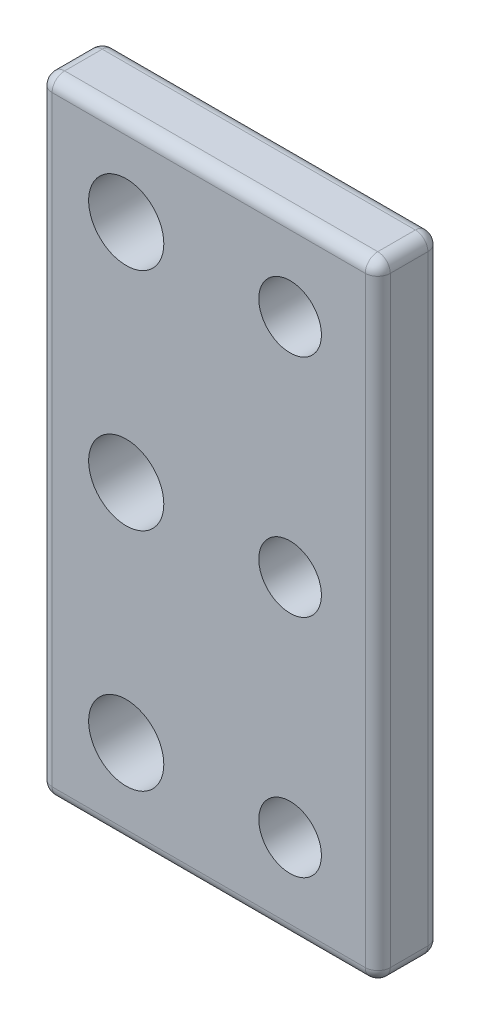
ISO-10303-21;
HEADER;
FILE_DESCRIPTION(('STEP AP214'),'2;1');
FILE_NAME('part.step','',(''),(''),'','','');
FILE_SCHEMA(('AUTOMOTIVE_DESIGN { 1 0 10303 214 1 1 1 1 }'));
ENDSEC;
DATA;
#1=APPLICATION_CONTEXT('core data for automotive mechanical design processes');
#2=APPLICATION_PROTOCOL_DEFINITION('international standard','automotive_design',2000,#1);
#3=PRODUCT_CONTEXT('',#1,'mechanical');
#4=PRODUCT('Part','Part','',(#3));
#5=PRODUCT_RELATED_PRODUCT_CATEGORY('part','',(#4));
#6=PRODUCT_DEFINITION_FORMATION('','',#4);
#7=PRODUCT_DEFINITION_CONTEXT('part definition',#1,'design');
#8=PRODUCT_DEFINITION('design','',#6,#7);
#9=PRODUCT_DEFINITION_SHAPE('','',#8);
#10=(LENGTH_UNIT() NAMED_UNIT(*) SI_UNIT(.MILLI.,.METRE.));
#11=(NAMED_UNIT(*) PLANE_ANGLE_UNIT() SI_UNIT($,.RADIAN.));
#12=(NAMED_UNIT(*) SI_UNIT($,.STERADIAN.) SOLID_ANGLE_UNIT());
#13=UNCERTAINTY_MEASURE_WITH_UNIT(LENGTH_MEASURE(1.E-05),#10,'distance_accuracy_value','');
#14=(GEOMETRIC_REPRESENTATION_CONTEXT(3) GLOBAL_UNCERTAINTY_ASSIGNED_CONTEXT((#13)) GLOBAL_UNIT_ASSIGNED_CONTEXT((#10,
#11,#12)) REPRESENTATION_CONTEXT('',''));
#15=CARTESIAN_POINT('',(0.,0.,0.));
#16=DIRECTION('',(0.,0.,1.));
#17=DIRECTION('',(1.,0.,0.));
#18=AXIS2_PLACEMENT_3D('',#15,#16,#17);
#19=CARTESIAN_POINT('',(0.,0.,5.));
#20=DIRECTION('',(0.,0.,1.));
#21=DIRECTION('',(1.,0.,0.));
#22=AXIS2_PLACEMENT_3D('',#19,#20,#21);
#23=PLANE('',#22);
#24=DIRECTION('',(0.,-1.,0.));
#25=VECTOR('',#24,1.);
#26=CARTESIAN_POINT('',(-12.5,-25.,5.));
#27=LINE('',#26,#25);
#28=CARTESIAN_POINT('',(-12.5,24.,5.));
#29=VERTEX_POINT('',#28);
#30=CARTESIAN_POINT('',(-12.5,-24.,5.));
#31=VERTEX_POINT('',#30);
#32=EDGE_CURVE('E136',#29,#31,#27,.T.);
#33=ORIENTED_EDGE('',*,*,#32,.T.);
#34=DIRECTION('',(1.,0.,0.));
#35=VECTOR('',#34,1.);
#36=CARTESIAN_POINT('',(13.5,-24.,5.));
#37=LINE('',#36,#35);
#38=CARTESIAN_POINT('',(12.5,-24.,5.));
#39=VERTEX_POINT('',#38);
#40=EDGE_CURVE('E181',#31,#39,#37,.T.);
#41=ORIENTED_EDGE('',*,*,#40,.T.);
#42=DIRECTION('',(0.,1.,0.));
#43=VECTOR('',#42,1.);
#44=CARTESIAN_POINT('',(12.5,25.,5.));
#45=LINE('',#44,#43);
#46=CARTESIAN_POINT('',(12.5,24.,5.));
#47=VERTEX_POINT('',#46);
#48=EDGE_CURVE('E139',#39,#47,#45,.T.);
#49=ORIENTED_EDGE('',*,*,#48,.T.);
#50=DIRECTION('',(-1.,0.,0.));
#51=VECTOR('',#50,1.);
#52=CARTESIAN_POINT('',(-13.5,24.,5.));
#53=LINE('',#52,#51);
#54=EDGE_CURVE('E131',#47,#29,#53,.T.);
#55=ORIENTED_EDGE('',*,*,#54,.T.);
#56=EDGE_LOOP('',(#33,#41,#49,#55));
#57=FACE_BOUND('',#56,.T.);
#58=CARTESIAN_POINT('',(6.5,0.,5.));
#59=DIRECTION('',(0.,0.,1.));
#60=DIRECTION('',(1.,0.,0.));
#61=AXIS2_PLACEMENT_3D('',#58,#59,#60);
#62=CIRCLE('',#61,2.5);
#63=CARTESIAN_POINT('',(9.,0.,5.));
#64=VERTEX_POINT('',#63);
#65=EDGE_CURVE('E334',#64,#64,#62,.T.);
#66=ORIENTED_EDGE('',*,*,#65,.F.);
#67=EDGE_LOOP('',(#66));
#68=FACE_BOUND('',#67,.T.);
#69=CARTESIAN_POINT('',(-6.58299282300101,-18.,5.));
#70=DIRECTION('',(0.,0.,1.));
#71=DIRECTION('',(1.,0.,0.));
#72=AXIS2_PLACEMENT_3D('',#69,#70,#71);
#73=CIRCLE('',#72,3.);
#74=CARTESIAN_POINT('',(-3.58299282300101,-18.,5.));
#75=VERTEX_POINT('',#74);
#76=EDGE_CURVE('E350',#75,#75,#73,.T.);
#77=ORIENTED_EDGE('',*,*,#76,.F.);
#78=EDGE_LOOP('',(#77));
#79=FACE_BOUND('',#78,.T.);
#80=CARTESIAN_POINT('',(-6.58299282300101,18.,5.));
#81=DIRECTION('',(0.,0.,1.));
#82=DIRECTION('',(1.,0.,0.));
#83=AXIS2_PLACEMENT_3D('',#80,#81,#82);
#84=CIRCLE('',#83,3.);
#85=CARTESIAN_POINT('',(-3.58299282300101,18.,5.));
#86=VERTEX_POINT('',#85);
#87=EDGE_CURVE('E171',#86,#86,#84,.T.);
#88=ORIENTED_EDGE('',*,*,#87,.F.);
#89=EDGE_LOOP('',(#88));
#90=FACE_BOUND('',#89,.T.);
#91=CARTESIAN_POINT('',(-6.58299282300101,0.,5.));
#92=DIRECTION('',(0.,0.,1.));
#93=DIRECTION('',(1.,0.,0.));
#94=AXIS2_PLACEMENT_3D('',#91,#92,#93);
#95=CIRCLE('',#94,3.);
#96=CARTESIAN_POINT('',(-3.58299282300101,0.,5.));
#97=VERTEX_POINT('',#96);
#98=EDGE_CURVE('E358',#97,#97,#95,.T.);
#99=ORIENTED_EDGE('',*,*,#98,.F.);
#100=EDGE_LOOP('',(#99));
#101=FACE_BOUND('',#100,.T.);
#102=CARTESIAN_POINT('',(6.5,18.,5.));
#103=DIRECTION('',(0.,0.,1.));
#104=DIRECTION('',(1.,0.,0.));
#105=AXIS2_PLACEMENT_3D('',#102,#103,#104);
#106=CIRCLE('',#105,2.5);
#107=CARTESIAN_POINT('',(9.,18.,5.));
#108=VERTEX_POINT('',#107);
#109=EDGE_CURVE('E342',#108,#108,#106,.T.);
#110=ORIENTED_EDGE('',*,*,#109,.F.);
#111=EDGE_LOOP('',(#110));
#112=FACE_BOUND('',#111,.T.);
#113=CARTESIAN_POINT('',(6.5,-18.,5.));
#114=DIRECTION('',(0.,0.,1.));
#115=DIRECTION('',(1.,0.,0.));
#116=AXIS2_PLACEMENT_3D('',#113,#114,#115);
#117=CIRCLE('',#116,2.5);
#118=CARTESIAN_POINT('',(9.,-18.,5.));
#119=VERTEX_POINT('',#118);
#120=EDGE_CURVE('E325',#119,#119,#117,.T.);
#121=ORIENTED_EDGE('',*,*,#120,.F.);
#122=EDGE_LOOP('',(#121));
#123=FACE_BOUND('',#122,.T.);
#124=ADVANCED_FACE('F43',(#57,#68,#79,#90,#101,#112,#123),#23,.T.);
#125=CARTESIAN_POINT('',(0.,0.,0.));
#126=DIRECTION('',(0.,0.,1.));
#127=DIRECTION('',(1.,0.,0.));
#128=AXIS2_PLACEMENT_3D('',#125,#126,#127);
#129=PLANE('',#128);
#130=DIRECTION('',(0.,1.,0.));
#131=VECTOR('',#130,1.);
#132=CARTESIAN_POINT('',(12.5,0.,0.));
#133=LINE('',#132,#131);
#134=CARTESIAN_POINT('',(12.5,24.,0.));
#135=VERTEX_POINT('',#134);
#136=CARTESIAN_POINT('',(12.5,-24.,0.));
#137=VERTEX_POINT('',#136);
#138=EDGE_CURVE('E203',#135,#137,#133,.F.);
#139=ORIENTED_EDGE('',*,*,#138,.T.);
#140=DIRECTION('',(1.,0.,0.));
#141=VECTOR('',#140,1.);
#142=CARTESIAN_POINT('',(0.,-24.,0.));
#143=LINE('',#142,#141);
#144=CARTESIAN_POINT('',(-12.5,-24.,0.));
#145=VERTEX_POINT('',#144);
#146=EDGE_CURVE('E206',#137,#145,#143,.F.);
#147=ORIENTED_EDGE('',*,*,#146,.T.);
#148=DIRECTION('',(0.,-1.,0.));
#149=VECTOR('',#148,1.);
#150=CARTESIAN_POINT('',(-12.5,0.,0.));
#151=LINE('',#150,#149);
#152=CARTESIAN_POINT('',(-12.5,24.,0.));
#153=VERTEX_POINT('',#152);
#154=EDGE_CURVE('E197',#145,#153,#151,.F.);
#155=ORIENTED_EDGE('',*,*,#154,.T.);
#156=DIRECTION('',(-1.,0.,0.));
#157=VECTOR('',#156,1.);
#158=CARTESIAN_POINT('',(0.,24.,0.));
#159=LINE('',#158,#157);
#160=EDGE_CURVE('E200',#153,#135,#159,.F.);
#161=ORIENTED_EDGE('',*,*,#160,.T.);
#162=EDGE_LOOP('',(#139,#147,#155,#161));
#163=FACE_BOUND('',#162,.T.);
#164=CARTESIAN_POINT('',(-6.58299282300101,18.,0.));
#165=DIRECTION('',(0.,0.,1.));
#166=DIRECTION('',(1.,0.,0.));
#167=AXIS2_PLACEMENT_3D('',#164,#165,#166);
#168=CIRCLE('',#167,3.);
#169=CARTESIAN_POINT('',(-3.58299282300101,18.,0.));
#170=VERTEX_POINT('',#169);
#171=EDGE_CURVE('E175',#170,#170,#168,.T.);
#172=ORIENTED_EDGE('',*,*,#171,.T.);
#173=EDGE_LOOP('',(#172));
#174=FACE_BOUND('',#173,.T.);
#175=CARTESIAN_POINT('',(-6.58299282300101,0.,0.));
#176=DIRECTION('',(0.,0.,1.));
#177=DIRECTION('',(1.,0.,0.));
#178=AXIS2_PLACEMENT_3D('',#175,#176,#177);
#179=CIRCLE('',#178,3.);
#180=CARTESIAN_POINT('',(-3.58299282300101,0.,0.));
#181=VERTEX_POINT('',#180);
#182=EDGE_CURVE('E354',#181,#181,#179,.T.);
#183=ORIENTED_EDGE('',*,*,#182,.T.);
#184=EDGE_LOOP('',(#183));
#185=FACE_BOUND('',#184,.T.);
#186=CARTESIAN_POINT('',(-6.58299282300101,-18.,0.));
#187=DIRECTION('',(0.,0.,1.));
#188=DIRECTION('',(1.,0.,0.));
#189=AXIS2_PLACEMENT_3D('',#186,#187,#188);
#190=CIRCLE('',#189,3.);
#191=CARTESIAN_POINT('',(-3.58299282300101,-18.,0.));
#192=VERTEX_POINT('',#191);
#193=EDGE_CURVE('E346',#192,#192,#190,.T.);
#194=ORIENTED_EDGE('',*,*,#193,.T.);
#195=EDGE_LOOP('',(#194));
#196=FACE_BOUND('',#195,.T.);
#197=CARTESIAN_POINT('',(6.5,18.,0.));
#198=DIRECTION('',(0.,0.,1.));
#199=DIRECTION('',(1.,0.,0.));
#200=AXIS2_PLACEMENT_3D('',#197,#198,#199);
#201=CIRCLE('',#200,2.5);
#202=CARTESIAN_POINT('',(9.,18.,0.));
#203=VERTEX_POINT('',#202);
#204=EDGE_CURVE('E338',#203,#203,#201,.T.);
#205=ORIENTED_EDGE('',*,*,#204,.T.);
#206=EDGE_LOOP('',(#205));
#207=FACE_BOUND('',#206,.T.);
#208=CARTESIAN_POINT('',(6.5,0.,0.));
#209=DIRECTION('',(0.,0.,1.));
#210=DIRECTION('',(1.,0.,0.));
#211=AXIS2_PLACEMENT_3D('',#208,#209,#210);
#212=CIRCLE('',#211,2.5);
#213=CARTESIAN_POINT('',(9.,0.,0.));
#214=VERTEX_POINT('',#213);
#215=EDGE_CURVE('E331',#214,#214,#212,.T.);
#216=ORIENTED_EDGE('',*,*,#215,.T.);
#217=EDGE_LOOP('',(#216));
#218=FACE_BOUND('',#217,.T.);
#219=CARTESIAN_POINT('',(6.5,-18.,0.));
#220=DIRECTION('',(0.,0.,1.));
#221=DIRECTION('',(1.,0.,0.));
#222=AXIS2_PLACEMENT_3D('',#219,#220,#221);
#223=CIRCLE('',#222,2.5);
#224=CARTESIAN_POINT('',(9.,-18.,0.));
#225=VERTEX_POINT('',#224);
#226=EDGE_CURVE('E318',#225,#225,#223,.T.);
#227=ORIENTED_EDGE('',*,*,#226,.T.);
#228=EDGE_LOOP('',(#227));
#229=FACE_BOUND('',#228,.T.);
#230=ADVANCED_FACE('F366',(#163,#174,#185,#196,#207,#218,#229),#129,.F.);
#231=CARTESIAN_POINT('',(13.5,25.,5.));
#232=DIRECTION('',(-1.,0.,0.));
#233=DIRECTION('',(0.,-1.,0.));
#234=AXIS2_PLACEMENT_3D('',#231,#232,#233);
#235=PLANE('',#234);
#236=DIRECTION('',(0.,1.,0.));
#237=VECTOR('',#236,1.);
#238=CARTESIAN_POINT('',(13.5,-25.,4.));
#239=LINE('',#238,#237);
#240=CARTESIAN_POINT('',(13.5,24.,4.));
#241=VERTEX_POINT('',#240);
#242=CARTESIAN_POINT('',(13.5,-24.,4.));
#243=VERTEX_POINT('',#242);
#244=EDGE_CURVE('E216',#241,#243,#239,.F.);
#245=ORIENTED_EDGE('',*,*,#244,.T.);
#246=DIRECTION('',(0.,0.,-1.));
#247=VECTOR('',#246,1.);
#248=CARTESIAN_POINT('',(13.5,-24.,5.));
#249=LINE('',#248,#247);
#250=CARTESIAN_POINT('',(13.5,-24.,1.));
#251=VERTEX_POINT('',#250);
#252=EDGE_CURVE('E219',#243,#251,#249,.T.);
#253=ORIENTED_EDGE('',*,*,#252,.T.);
#254=DIRECTION('',(0.,1.,0.));
#255=VECTOR('',#254,1.);
#256=CARTESIAN_POINT('',(13.5,25.,1.));
#257=LINE('',#256,#255);
#258=CARTESIAN_POINT('',(13.5,24.,1.));
#259=VERTEX_POINT('',#258);
#260=EDGE_CURVE('E213',#251,#259,#257,.T.);
#261=ORIENTED_EDGE('',*,*,#260,.T.);
#262=DIRECTION('',(0.,0.,-1.));
#263=VECTOR('',#262,1.);
#264=CARTESIAN_POINT('',(13.5,24.,5.));
#265=LINE('',#264,#263);
#266=EDGE_CURVE('E210',#259,#241,#265,.F.);
#267=ORIENTED_EDGE('',*,*,#266,.T.);
#268=EDGE_LOOP('',(#245,#253,#261,#267));
#269=FACE_BOUND('',#268,.T.);
#270=ADVANCED_FACE('F390',(#269),#235,.F.);
#271=CARTESIAN_POINT('',(-13.5,25.,5.));
#272=DIRECTION('',(0.,-1.,0.));
#273=DIRECTION('',(0.,0.,-1.));
#274=AXIS2_PLACEMENT_3D('',#271,#272,#273);
#275=PLANE('',#274);
#276=DIRECTION('',(-1.,0.,0.));
#277=VECTOR('',#276,1.);
#278=CARTESIAN_POINT('',(13.5,25.,4.));
#279=LINE('',#278,#277);
#280=CARTESIAN_POINT('',(-12.5,25.,4.));
#281=VERTEX_POINT('',#280);
#282=CARTESIAN_POINT('',(12.5,25.,4.));
#283=VERTEX_POINT('',#282);
#284=EDGE_CURVE('E150',#281,#283,#279,.F.);
#285=ORIENTED_EDGE('',*,*,#284,.T.);
#286=DIRECTION('',(0.,0.,-1.));
#287=VECTOR('',#286,1.);
#288=CARTESIAN_POINT('',(12.5,25.,5.));
#289=LINE('',#288,#287);
#290=CARTESIAN_POINT('',(12.5,25.,1.));
#291=VERTEX_POINT('',#290);
#292=EDGE_CURVE('E231',#283,#291,#289,.T.);
#293=ORIENTED_EDGE('',*,*,#292,.T.);
#294=DIRECTION('',(-1.,0.,0.));
#295=VECTOR('',#294,1.);
#296=CARTESIAN_POINT('',(-13.5,25.,1.));
#297=LINE('',#296,#295);
#298=CARTESIAN_POINT('',(-12.5,25.,1.));
#299=VERTEX_POINT('',#298);
#300=EDGE_CURVE('E226',#291,#299,#297,.T.);
#301=ORIENTED_EDGE('',*,*,#300,.T.);
#302=DIRECTION('',(0.,0.,-1.));
#303=VECTOR('',#302,1.);
#304=CARTESIAN_POINT('',(-12.5,25.,5.));
#305=LINE('',#304,#303);
#306=EDGE_CURVE('E223',#299,#281,#305,.F.);
#307=ORIENTED_EDGE('',*,*,#306,.T.);
#308=EDGE_LOOP('',(#285,#293,#301,#307));
#309=FACE_BOUND('',#308,.T.);
#310=ADVANCED_FACE('F400',(#309),#275,.F.);
#311=CARTESIAN_POINT('',(-13.5,25.,5.));
#312=DIRECTION('',(1.,0.,0.));
#313=DIRECTION('',(0.,1.,0.));
#314=AXIS2_PLACEMENT_3D('',#311,#312,#313);
#315=PLANE('',#314);
#316=DIRECTION('',(0.,-1.,0.));
#317=VECTOR('',#316,1.);
#318=CARTESIAN_POINT('',(-13.5,25.,4.));
#319=LINE('',#318,#317);
#320=CARTESIAN_POINT('',(-13.5,-24.,4.));
#321=VERTEX_POINT('',#320);
#322=CARTESIAN_POINT('',(-13.5,24.,4.));
#323=VERTEX_POINT('',#322);
#324=EDGE_CURVE('E53',#321,#323,#319,.F.);
#325=ORIENTED_EDGE('',*,*,#324,.T.);
#326=DIRECTION('',(0.,0.,-1.));
#327=VECTOR('',#326,1.);
#328=CARTESIAN_POINT('',(-13.5,24.,5.));
#329=LINE('',#328,#327);
#330=CARTESIAN_POINT('',(-13.5,24.,1.));
#331=VERTEX_POINT('',#330);
#332=EDGE_CURVE('E11',#323,#331,#329,.T.);
#333=ORIENTED_EDGE('',*,*,#332,.T.);
#334=DIRECTION('',(0.,-1.,0.));
#335=VECTOR('',#334,1.);
#336=CARTESIAN_POINT('',(-13.5,25.,1.));
#337=LINE('',#336,#335);
#338=CARTESIAN_POINT('',(-13.5,-24.,1.));
#339=VERTEX_POINT('',#338);
#340=EDGE_CURVE('E235',#331,#339,#337,.T.);
#341=ORIENTED_EDGE('',*,*,#340,.T.);
#342=DIRECTION('',(0.,0.,-1.));
#343=VECTOR('',#342,1.);
#344=CARTESIAN_POINT('',(-13.5,-24.,5.));
#345=LINE('',#344,#343);
#346=EDGE_CURVE('E64',#339,#321,#345,.F.);
#347=ORIENTED_EDGE('',*,*,#346,.T.);
#348=EDGE_LOOP('',(#325,#333,#341,#347));
#349=FACE_BOUND('',#348,.T.);
#350=ADVANCED_FACE('F396',(#349),#315,.F.);
#351=CARTESIAN_POINT('',(-13.5,-25.,5.));
#352=DIRECTION('',(0.,1.,0.));
#353=DIRECTION('',(0.,0.,1.));
#354=AXIS2_PLACEMENT_3D('',#351,#352,#353);
#355=PLANE('',#354);
#356=DIRECTION('',(1.,0.,0.));
#357=VECTOR('',#356,1.);
#358=CARTESIAN_POINT('',(-13.5,-25.,1.));
#359=LINE('',#358,#357);
#360=CARTESIAN_POINT('',(-12.5,-25.,1.));
#361=VERTEX_POINT('',#360);
#362=CARTESIAN_POINT('',(12.5,-25.,1.));
#363=VERTEX_POINT('',#362);
#364=EDGE_CURVE('E187',#361,#363,#359,.T.);
#365=ORIENTED_EDGE('',*,*,#364,.T.);
#366=DIRECTION('',(0.,0.,-1.));
#367=VECTOR('',#366,1.);
#368=CARTESIAN_POINT('',(12.5,-25.,5.));
#369=LINE('',#368,#367);
#370=CARTESIAN_POINT('',(12.5,-25.,4.));
#371=VERTEX_POINT('',#370);
#372=EDGE_CURVE('E194',#363,#371,#369,.F.);
#373=ORIENTED_EDGE('',*,*,#372,.T.);
#374=DIRECTION('',(1.,0.,0.));
#375=VECTOR('',#374,1.);
#376=CARTESIAN_POINT('',(-13.5,-25.,4.));
#377=LINE('',#376,#375);
#378=CARTESIAN_POINT('',(-12.5,-25.,4.));
#379=VERTEX_POINT('',#378);
#380=EDGE_CURVE('E190',#371,#379,#377,.F.);
#381=ORIENTED_EDGE('',*,*,#380,.T.);
#382=DIRECTION('',(0.,0.,-1.));
#383=VECTOR('',#382,1.);
#384=CARTESIAN_POINT('',(-12.5,-25.,5.));
#385=LINE('',#384,#383);
#386=EDGE_CURVE('E184',#379,#361,#385,.T.);
#387=ORIENTED_EDGE('',*,*,#386,.T.);
#388=EDGE_LOOP('',(#365,#373,#381,#387));
#389=FACE_BOUND('',#388,.T.);
#390=ADVANCED_FACE('F382',(#389),#355,.F.);
#391=CARTESIAN_POINT('',(-6.58299282300101,18.,5.));
#392=DIRECTION('',(0.,0.,-1.));
#393=DIRECTION('',(-1.,0.,0.));
#394=AXIS2_PLACEMENT_3D('',#391,#392,#393);
#395=CYLINDRICAL_SURFACE('',#394,3.);
#396=ORIENTED_EDGE('',*,*,#87,.T.);
#397=EDGE_LOOP('',(#396));
#398=FACE_BOUND('',#397,.T.);
#399=ORIENTED_EDGE('',*,*,#171,.F.);
#400=EDGE_LOOP('',(#399));
#401=FACE_BOUND('',#400,.T.);
#402=ADVANCED_FACE('F372',(#398,#401),#395,.F.);
#403=CARTESIAN_POINT('',(-6.58299282300101,0.,5.));
#404=DIRECTION('',(0.,0.,-1.));
#405=DIRECTION('',(-1.,0.,0.));
#406=AXIS2_PLACEMENT_3D('',#403,#404,#405);
#407=CYLINDRICAL_SURFACE('',#406,3.);
#408=ORIENTED_EDGE('',*,*,#98,.T.);
#409=EDGE_LOOP('',(#408));
#410=FACE_BOUND('',#409,.T.);
#411=ORIENTED_EDGE('',*,*,#182,.F.);
#412=EDGE_LOOP('',(#411));
#413=FACE_BOUND('',#412,.T.);
#414=ADVANCED_FACE('F369',(#410,#413),#407,.F.);
#415=CARTESIAN_POINT('',(-6.58299282300101,-18.,5.));
#416=DIRECTION('',(0.,0.,-1.));
#417=DIRECTION('',(-1.,0.,0.));
#418=AXIS2_PLACEMENT_3D('',#415,#416,#417);
#419=CYLINDRICAL_SURFACE('',#418,3.);
#420=ORIENTED_EDGE('',*,*,#76,.T.);
#421=EDGE_LOOP('',(#420));
#422=FACE_BOUND('',#421,.T.);
#423=ORIENTED_EDGE('',*,*,#193,.F.);
#424=EDGE_LOOP('',(#423));
#425=FACE_BOUND('',#424,.T.);
#426=ADVANCED_FACE('F371',(#422,#425),#419,.F.);
#427=CARTESIAN_POINT('',(6.5,18.,5.));
#428=DIRECTION('',(0.,0.,-1.));
#429=DIRECTION('',(-1.,0.,0.));
#430=AXIS2_PLACEMENT_3D('',#427,#428,#429);
#431=CYLINDRICAL_SURFACE('',#430,2.5);
#432=ORIENTED_EDGE('',*,*,#109,.T.);
#433=EDGE_LOOP('',(#432));
#434=FACE_BOUND('',#433,.T.);
#435=ORIENTED_EDGE('',*,*,#204,.F.);
#436=EDGE_LOOP('',(#435));
#437=FACE_BOUND('',#436,.T.);
#438=ADVANCED_FACE('F379',(#434,#437),#431,.F.);
#439=CARTESIAN_POINT('',(6.5,0.,5.));
#440=DIRECTION('',(0.,0.,-1.));
#441=DIRECTION('',(-1.,0.,0.));
#442=AXIS2_PLACEMENT_3D('',#439,#440,#441);
#443=CYLINDRICAL_SURFACE('',#442,2.5);
#444=ORIENTED_EDGE('',*,*,#65,.T.);
#445=EDGE_LOOP('',(#444));
#446=FACE_BOUND('',#445,.T.);
#447=ORIENTED_EDGE('',*,*,#215,.F.);
#448=EDGE_LOOP('',(#447));
#449=FACE_BOUND('',#448,.T.);
#450=ADVANCED_FACE('F513',(#446,#449),#443,.F.);
#451=CARTESIAN_POINT('',(6.5,-18.,5.));
#452=DIRECTION('',(0.,0.,-1.));
#453=DIRECTION('',(-1.,0.,0.));
#454=AXIS2_PLACEMENT_3D('',#451,#452,#453);
#455=CYLINDRICAL_SURFACE('',#454,2.5);
#456=ORIENTED_EDGE('',*,*,#120,.T.);
#457=EDGE_LOOP('',(#456));
#458=FACE_BOUND('',#457,.T.);
#459=ORIENTED_EDGE('',*,*,#226,.F.);
#460=EDGE_LOOP('',(#459));
#461=FACE_BOUND('',#460,.T.);
#462=ADVANCED_FACE('F476',(#458,#461),#455,.F.);
#463=CARTESIAN_POINT('',(-13.5,24.,1.));
#464=DIRECTION('',(-1.,0.,0.));
#465=DIRECTION('',(0.,0.,1.));
#466=AXIS2_PLACEMENT_3D('',#463,#464,#465);
#467=CYLINDRICAL_SURFACE('',#466,1.);
#468=CARTESIAN_POINT('',(-12.5,24.,1.));
#469=DIRECTION('',(-1.,0.,0.));
#470=DIRECTION('',(0.,0.,1.));
#471=AXIS2_PLACEMENT_3D('',#468,#469,#470);
#472=CIRCLE('',#471,1.);
#473=EDGE_CURVE('E47',#299,#153,#472,.T.);
#474=ORIENTED_EDGE('',*,*,#473,.F.);
#475=ORIENTED_EDGE('',*,*,#300,.F.);
#476=CARTESIAN_POINT('',(12.5,24.,1.));
#477=DIRECTION('',(1.,0.,0.));
#478=DIRECTION('',(0.,0.,-1.));
#479=AXIS2_PLACEMENT_3D('',#476,#477,#478);
#480=CIRCLE('',#479,1.);
#481=EDGE_CURVE('E308',#135,#291,#480,.T.);
#482=ORIENTED_EDGE('',*,*,#481,.F.);
#483=ORIENTED_EDGE('',*,*,#160,.F.);
#484=EDGE_LOOP('',(#474,#475,#482,#483));
#485=FACE_BOUND('',#484,.T.);
#486=ADVANCED_FACE('F45',(#485),#467,.T.);
#487=CARTESIAN_POINT('',(-12.5,24.,1.));
#488=DIRECTION('',(0.,0.,-1.));
#489=DIRECTION('',(-1.,0.,0.));
#490=AXIS2_PLACEMENT_3D('',#487,#488,#489);
#491=SPHERICAL_SURFACE('',#490,1.);
#492=CARTESIAN_POINT('',(-12.5,24.,1.));
#493=DIRECTION('',(0.,0.,-1.));
#494=DIRECTION('',(-1.,0.,0.));
#495=AXIS2_PLACEMENT_3D('',#492,#493,#494);
#496=CIRCLE('',#495,1.);
#497=EDGE_CURVE('E301',#299,#331,#496,.F.);
#498=ORIENTED_EDGE('',*,*,#497,.F.);
#499=ORIENTED_EDGE('',*,*,#473,.T.);
#500=CARTESIAN_POINT('',(-12.5,24.,1.));
#501=DIRECTION('',(0.,1.,0.));
#502=DIRECTION('',(0.,0.,1.));
#503=AXIS2_PLACEMENT_3D('',#500,#501,#502);
#504=CIRCLE('',#503,1.);
#505=EDGE_CURVE('E305',#331,#153,#504,.F.);
#506=ORIENTED_EDGE('',*,*,#505,.F.);
#507=EDGE_LOOP('',(#498,#499,#506));
#508=FACE_BOUND('',#507,.T.);
#509=ADVANCED_FACE('F471',(#508),#491,.T.);
#510=CARTESIAN_POINT('',(12.5,24.,1.));
#511=DIRECTION('',(0.,1.,0.));
#512=DIRECTION('',(0.,0.,1.));
#513=AXIS2_PLACEMENT_3D('',#510,#511,#512);
#514=SPHERICAL_SURFACE('',#513,1.);
#515=CARTESIAN_POINT('',(12.5,24.,1.));
#516=DIRECTION('',(0.,1.,0.));
#517=DIRECTION('',(0.,0.,1.));
#518=AXIS2_PLACEMENT_3D('',#515,#516,#517);
#519=CIRCLE('',#518,1.);
#520=EDGE_CURVE('E294',#135,#259,#519,.F.);
#521=ORIENTED_EDGE('',*,*,#520,.F.);
#522=ORIENTED_EDGE('',*,*,#481,.T.);
#523=CARTESIAN_POINT('',(12.5,24.,1.));
#524=DIRECTION('',(0.,0.,-1.));
#525=DIRECTION('',(-1.,0.,0.));
#526=AXIS2_PLACEMENT_3D('',#523,#524,#525);
#527=CIRCLE('',#526,1.);
#528=EDGE_CURVE('E298',#259,#291,#527,.F.);
#529=ORIENTED_EDGE('',*,*,#528,.F.);
#530=EDGE_LOOP('',(#521,#522,#529));
#531=FACE_BOUND('',#530,.T.);
#532=ADVANCED_FACE('F468',(#531),#514,.T.);
#533=CARTESIAN_POINT('',(-12.5,25.,1.));
#534=DIRECTION('',(0.,-1.,0.));
#535=DIRECTION('',(1.,0.,0.));
#536=AXIS2_PLACEMENT_3D('',#533,#534,#535);
#537=CYLINDRICAL_SURFACE('',#536,1.);
#538=ORIENTED_EDGE('',*,*,#505,.T.);
#539=ORIENTED_EDGE('',*,*,#154,.F.);
#540=CARTESIAN_POINT('',(-12.5,-24.,1.));
#541=DIRECTION('',(0.,-1.,0.));
#542=DIRECTION('',(0.,0.,-1.));
#543=AXIS2_PLACEMENT_3D('',#540,#541,#542);
#544=CIRCLE('',#543,1.);
#545=EDGE_CURVE('E287',#339,#145,#544,.T.);
#546=ORIENTED_EDGE('',*,*,#545,.F.);
#547=ORIENTED_EDGE('',*,*,#340,.F.);
#548=EDGE_LOOP('',(#538,#539,#546,#547));
#549=FACE_BOUND('',#548,.T.);
#550=ADVANCED_FACE('F464',(#549),#537,.T.);
#551=CARTESIAN_POINT('',(-12.5,24.,5.));
#552=DIRECTION('',(0.,0.,-1.));
#553=DIRECTION('',(-1.,0.,0.));
#554=AXIS2_PLACEMENT_3D('',#551,#552,#553);
#555=CYLINDRICAL_SURFACE('',#554,1.);
#556=ORIENTED_EDGE('',*,*,#497,.T.);
#557=ORIENTED_EDGE('',*,*,#332,.F.);
#558=CARTESIAN_POINT('',(-12.5,24.,4.));
#559=DIRECTION('',(0.,0.,1.));
#560=DIRECTION('',(1.,0.,0.));
#561=AXIS2_PLACEMENT_3D('',#558,#559,#560);
#562=CIRCLE('',#561,1.);
#563=EDGE_CURVE('E155',#281,#323,#562,.T.);
#564=ORIENTED_EDGE('',*,*,#563,.F.);
#565=ORIENTED_EDGE('',*,*,#306,.F.);
#566=EDGE_LOOP('',(#556,#557,#564,#565));
#567=FACE_BOUND('',#566,.T.);
#568=ADVANCED_FACE('F461',(#567),#555,.T.);
#569=CARTESIAN_POINT('',(0.,24.,4.));
#570=DIRECTION('',(1.,0.,0.));
#571=DIRECTION('',(0.,0.,-1.));
#572=AXIS2_PLACEMENT_3D('',#569,#570,#571);
#573=CYLINDRICAL_SURFACE('',#572,1.);
#574=CARTESIAN_POINT('',(12.5,24.,4.));
#575=DIRECTION('',(1.,0.,0.));
#576=DIRECTION('',(0.,0.,-1.));
#577=AXIS2_PLACEMENT_3D('',#574,#575,#576);
#578=CIRCLE('',#577,1.);
#579=EDGE_CURVE('E156',#283,#47,#578,.T.);
#580=ORIENTED_EDGE('',*,*,#579,.F.);
#581=ORIENTED_EDGE('',*,*,#284,.F.);
#582=CARTESIAN_POINT('',(-12.5,24.,4.));
#583=DIRECTION('',(-1.,0.,0.));
#584=DIRECTION('',(0.,0.,1.));
#585=AXIS2_PLACEMENT_3D('',#582,#583,#584);
#586=CIRCLE('',#585,1.);
#587=EDGE_CURVE('E147',#29,#281,#586,.T.);
#588=ORIENTED_EDGE('',*,*,#587,.F.);
#589=ORIENTED_EDGE('',*,*,#54,.F.);
#590=EDGE_LOOP('',(#580,#581,#588,#589));
#591=FACE_BOUND('',#590,.T.);
#592=ADVANCED_FACE('F149',(#591),#573,.T.);
#593=CARTESIAN_POINT('',(12.5,24.,5.));
#594=DIRECTION('',(0.,0.,-1.));
#595=DIRECTION('',(-1.,0.,0.));
#596=AXIS2_PLACEMENT_3D('',#593,#594,#595);
#597=CYLINDRICAL_SURFACE('',#596,1.);
#598=ORIENTED_EDGE('',*,*,#528,.T.);
#599=ORIENTED_EDGE('',*,*,#292,.F.);
#600=CARTESIAN_POINT('',(12.5,24.,4.));
#601=DIRECTION('',(0.,0.,1.));
#602=DIRECTION('',(1.,0.,0.));
#603=AXIS2_PLACEMENT_3D('',#600,#601,#602);
#604=CIRCLE('',#603,1.);
#605=EDGE_CURVE('E279',#241,#283,#604,.T.);
#606=ORIENTED_EDGE('',*,*,#605,.F.);
#607=ORIENTED_EDGE('',*,*,#266,.F.);
#608=EDGE_LOOP('',(#598,#599,#606,#607));
#609=FACE_BOUND('',#608,.T.);
#610=ADVANCED_FACE('F454',(#609),#597,.T.);
#611=CARTESIAN_POINT('',(12.5,25.,1.));
#612=DIRECTION('',(0.,1.,0.));
#613=DIRECTION('',(-1.,0.,0.));
#614=AXIS2_PLACEMENT_3D('',#611,#612,#613);
#615=CYLINDRICAL_SURFACE('',#614,1.);
#616=ORIENTED_EDGE('',*,*,#520,.T.);
#617=ORIENTED_EDGE('',*,*,#260,.F.);
#618=CARTESIAN_POINT('',(12.5,-24.,1.));
#619=DIRECTION('',(0.,-1.,0.));
#620=DIRECTION('',(0.,0.,-1.));
#621=AXIS2_PLACEMENT_3D('',#618,#619,#620);
#622=CIRCLE('',#621,1.);
#623=EDGE_CURVE('E275',#137,#251,#622,.T.);
#624=ORIENTED_EDGE('',*,*,#623,.F.);
#625=ORIENTED_EDGE('',*,*,#138,.F.);
#626=EDGE_LOOP('',(#616,#617,#624,#625));
#627=FACE_BOUND('',#626,.T.);
#628=ADVANCED_FACE('F450',(#627),#615,.T.);
#629=CARTESIAN_POINT('',(-13.5,-24.,1.));
#630=DIRECTION('',(1.,0.,0.));
#631=DIRECTION('',(0.,0.,-1.));
#632=AXIS2_PLACEMENT_3D('',#629,#630,#631);
#633=CYLINDRICAL_SURFACE('',#632,1.);
#634=CARTESIAN_POINT('',(-12.5,-24.,1.));
#635=DIRECTION('',(-1.,0.,0.));
#636=DIRECTION('',(0.,0.,1.));
#637=AXIS2_PLACEMENT_3D('',#634,#635,#636);
#638=CIRCLE('',#637,1.);
#639=EDGE_CURVE('E290',#145,#361,#638,.T.);
#640=ORIENTED_EDGE('',*,*,#639,.F.);
#641=ORIENTED_EDGE('',*,*,#146,.F.);
#642=CARTESIAN_POINT('',(12.5,-24.,1.));
#643=DIRECTION('',(1.,0.,0.));
#644=DIRECTION('',(0.,0.,-1.));
#645=AXIS2_PLACEMENT_3D('',#642,#643,#644);
#646=CIRCLE('',#645,1.);
#647=EDGE_CURVE('E271',#363,#137,#646,.T.);
#648=ORIENTED_EDGE('',*,*,#647,.F.);
#649=ORIENTED_EDGE('',*,*,#364,.F.);
#650=EDGE_LOOP('',(#640,#641,#648,#649));
#651=FACE_BOUND('',#650,.T.);
#652=ADVANCED_FACE('F446',(#651),#633,.T.);
#653=CARTESIAN_POINT('',(-12.5,-24.,1.));
#654=DIRECTION('',(0.,0.,-1.));
#655=DIRECTION('',(-1.,0.,0.));
#656=AXIS2_PLACEMENT_3D('',#653,#654,#655);
#657=SPHERICAL_SURFACE('',#656,1.);
#658=ORIENTED_EDGE('',*,*,#545,.T.);
#659=ORIENTED_EDGE('',*,*,#639,.T.);
#660=CARTESIAN_POINT('',(-12.5,-24.,1.));
#661=DIRECTION('',(0.,0.,-1.));
#662=DIRECTION('',(-1.,0.,0.));
#663=AXIS2_PLACEMENT_3D('',#660,#661,#662);
#664=CIRCLE('',#663,1.);
#665=EDGE_CURVE('E163',#339,#361,#664,.F.);
#666=ORIENTED_EDGE('',*,*,#665,.F.);
#667=EDGE_LOOP('',(#658,#659,#666));
#668=FACE_BOUND('',#667,.T.);
#669=ADVANCED_FACE('F443',(#668),#657,.T.);
#670=CARTESIAN_POINT('',(-12.5,24.,4.));
#671=DIRECTION('',(0.,1.,0.));
#672=DIRECTION('',(0.,0.,1.));
#673=AXIS2_PLACEMENT_3D('',#670,#671,#672);
#674=SPHERICAL_SURFACE('',#673,1.);
#675=ORIENTED_EDGE('',*,*,#587,.T.);
#676=ORIENTED_EDGE('',*,*,#563,.T.);
#677=CARTESIAN_POINT('',(-12.5,24.,4.));
#678=DIRECTION('',(0.,1.,0.));
#679=DIRECTION('',(0.,0.,1.));
#680=AXIS2_PLACEMENT_3D('',#677,#678,#679);
#681=CIRCLE('',#680,1.);
#682=EDGE_CURVE('E159',#29,#323,#681,.F.);
#683=ORIENTED_EDGE('',*,*,#682,.F.);
#684=EDGE_LOOP('',(#675,#676,#683));
#685=FACE_BOUND('',#684,.T.);
#686=ADVANCED_FACE('F160',(#685),#674,.T.);
#687=CARTESIAN_POINT('',(12.5,24.,4.));
#688=DIRECTION('',(0.,1.,0.));
#689=DIRECTION('',(0.,0.,1.));
#690=AXIS2_PLACEMENT_3D('',#687,#688,#689);
#691=SPHERICAL_SURFACE('',#690,1.);
#692=ORIENTED_EDGE('',*,*,#605,.T.);
#693=ORIENTED_EDGE('',*,*,#579,.T.);
#694=CARTESIAN_POINT('',(12.5,24.,4.));
#695=DIRECTION('',(0.,1.,0.));
#696=DIRECTION('',(0.,0.,1.));
#697=AXIS2_PLACEMENT_3D('',#694,#695,#696);
#698=CIRCLE('',#697,1.);
#699=EDGE_CURVE('E164',#241,#47,#698,.F.);
#700=ORIENTED_EDGE('',*,*,#699,.F.);
#701=EDGE_LOOP('',(#692,#693,#700));
#702=FACE_BOUND('',#701,.T.);
#703=ADVANCED_FACE('F436',(#702),#691,.T.);
#704=CARTESIAN_POINT('',(12.5,-24.,1.));
#705=DIRECTION('',(0.,0.,-1.));
#706=DIRECTION('',(-1.,0.,0.));
#707=AXIS2_PLACEMENT_3D('',#704,#705,#706);
#708=SPHERICAL_SURFACE('',#707,1.);
#709=ORIENTED_EDGE('',*,*,#647,.T.);
#710=ORIENTED_EDGE('',*,*,#623,.T.);
#711=CARTESIAN_POINT('',(12.5,-24.,1.));
#712=DIRECTION('',(0.,0.,-1.));
#713=DIRECTION('',(-1.,0.,0.));
#714=AXIS2_PLACEMENT_3D('',#711,#712,#713);
#715=CIRCLE('',#714,1.);
#716=EDGE_CURVE('E262',#363,#251,#715,.F.);
#717=ORIENTED_EDGE('',*,*,#716,.F.);
#718=EDGE_LOOP('',(#709,#710,#717));
#719=FACE_BOUND('',#718,.T.);
#720=ADVANCED_FACE('F432',(#719),#708,.T.);
#721=CARTESIAN_POINT('',(-12.5,-24.,5.));
#722=DIRECTION('',(0.,0.,-1.));
#723=DIRECTION('',(-1.,0.,0.));
#724=AXIS2_PLACEMENT_3D('',#721,#722,#723);
#725=CYLINDRICAL_SURFACE('',#724,1.);
#726=ORIENTED_EDGE('',*,*,#665,.T.);
#727=ORIENTED_EDGE('',*,*,#386,.F.);
#728=CARTESIAN_POINT('',(-12.5,-24.,4.));
#729=DIRECTION('',(0.,0.,1.));
#730=DIRECTION('',(1.,0.,0.));
#731=AXIS2_PLACEMENT_3D('',#728,#729,#730);
#732=CIRCLE('',#731,1.);
#733=EDGE_CURVE('E258',#321,#379,#732,.T.);
#734=ORIENTED_EDGE('',*,*,#733,.F.);
#735=ORIENTED_EDGE('',*,*,#346,.F.);
#736=EDGE_LOOP('',(#726,#727,#734,#735));
#737=FACE_BOUND('',#736,.T.);
#738=ADVANCED_FACE('F429',(#737),#725,.T.);
#739=CARTESIAN_POINT('',(-12.5,0.,4.));
#740=DIRECTION('',(0.,1.,0.));
#741=DIRECTION('',(-1.,0.,0.));
#742=AXIS2_PLACEMENT_3D('',#739,#740,#741);
#743=CYLINDRICAL_SURFACE('',#742,1.);
#744=ORIENTED_EDGE('',*,*,#682,.T.);
#745=ORIENTED_EDGE('',*,*,#324,.F.);
#746=CARTESIAN_POINT('',(-12.5,-24.,4.));
#747=DIRECTION('',(0.,-1.,0.));
#748=DIRECTION('',(0.,0.,-1.));
#749=AXIS2_PLACEMENT_3D('',#746,#747,#748);
#750=CIRCLE('',#749,1.);
#751=EDGE_CURVE('E168',#31,#321,#750,.T.);
#752=ORIENTED_EDGE('',*,*,#751,.F.);
#753=ORIENTED_EDGE('',*,*,#32,.F.);
#754=EDGE_LOOP('',(#744,#745,#752,#753));
#755=FACE_BOUND('',#754,.T.);
#756=ADVANCED_FACE('F166',(#755),#743,.T.);
#757=CARTESIAN_POINT('',(12.5,0.,4.));
#758=DIRECTION('',(0.,-1.,0.));
#759=DIRECTION('',(1.,0.,0.));
#760=AXIS2_PLACEMENT_3D('',#757,#758,#759);
#761=CYLINDRICAL_SURFACE('',#760,1.);
#762=ORIENTED_EDGE('',*,*,#699,.T.);
#763=ORIENTED_EDGE('',*,*,#48,.F.);
#764=CARTESIAN_POINT('',(12.5,-24.,4.));
#765=DIRECTION('',(0.,-1.,0.));
#766=DIRECTION('',(0.,0.,-1.));
#767=AXIS2_PLACEMENT_3D('',#764,#765,#766);
#768=CIRCLE('',#767,1.);
#769=EDGE_CURVE('E252',#243,#39,#768,.T.);
#770=ORIENTED_EDGE('',*,*,#769,.F.);
#771=ORIENTED_EDGE('',*,*,#244,.F.);
#772=EDGE_LOOP('',(#762,#763,#770,#771));
#773=FACE_BOUND('',#772,.T.);
#774=ADVANCED_FACE('F422',(#773),#761,.T.);
#775=CARTESIAN_POINT('',(12.5,-24.,5.));
#776=DIRECTION('',(0.,0.,-1.));
#777=DIRECTION('',(-1.,0.,0.));
#778=AXIS2_PLACEMENT_3D('',#775,#776,#777);
#779=CYLINDRICAL_SURFACE('',#778,1.);
#780=ORIENTED_EDGE('',*,*,#716,.T.);
#781=ORIENTED_EDGE('',*,*,#252,.F.);
#782=CARTESIAN_POINT('',(12.5,-24.,4.));
#783=DIRECTION('',(0.,0.,1.));
#784=DIRECTION('',(1.,0.,0.));
#785=AXIS2_PLACEMENT_3D('',#782,#783,#784);
#786=CIRCLE('',#785,1.);
#787=EDGE_CURVE('E248',#371,#243,#786,.T.);
#788=ORIENTED_EDGE('',*,*,#787,.F.);
#789=ORIENTED_EDGE('',*,*,#372,.F.);
#790=EDGE_LOOP('',(#780,#781,#788,#789));
#791=FACE_BOUND('',#790,.T.);
#792=ADVANCED_FACE('F418',(#791),#779,.T.);
#793=CARTESIAN_POINT('',(-12.5,-24.,4.));
#794=DIRECTION('',(-1.,0.,0.));
#795=DIRECTION('',(0.,0.,1.));
#796=AXIS2_PLACEMENT_3D('',#793,#794,#795);
#797=SPHERICAL_SURFACE('',#796,1.);
#798=ORIENTED_EDGE('',*,*,#751,.T.);
#799=ORIENTED_EDGE('',*,*,#733,.T.);
#800=CARTESIAN_POINT('',(-12.5,-24.,4.));
#801=DIRECTION('',(-1.,0.,0.));
#802=DIRECTION('',(0.,0.,1.));
#803=AXIS2_PLACEMENT_3D('',#800,#801,#802);
#804=CIRCLE('',#803,1.);
#805=EDGE_CURVE('E245',#31,#379,#804,.F.);
#806=ORIENTED_EDGE('',*,*,#805,.F.);
#807=EDGE_LOOP('',(#798,#799,#806));
#808=FACE_BOUND('',#807,.T.);
#809=ADVANCED_FACE('F414',(#808),#797,.T.);
#810=CARTESIAN_POINT('',(12.5,-24.,4.));
#811=DIRECTION('',(1.,0.,0.));
#812=DIRECTION('',(0.,0.,-1.));
#813=AXIS2_PLACEMENT_3D('',#810,#811,#812);
#814=SPHERICAL_SURFACE('',#813,1.);
#815=ORIENTED_EDGE('',*,*,#787,.T.);
#816=ORIENTED_EDGE('',*,*,#769,.T.);
#817=CARTESIAN_POINT('',(12.5,-24.,4.));
#818=DIRECTION('',(1.,0.,0.));
#819=DIRECTION('',(0.,0.,-1.));
#820=AXIS2_PLACEMENT_3D('',#817,#818,#819);
#821=CIRCLE('',#820,1.);
#822=EDGE_CURVE('E242',#371,#39,#821,.F.);
#823=ORIENTED_EDGE('',*,*,#822,.F.);
#824=EDGE_LOOP('',(#815,#816,#823));
#825=FACE_BOUND('',#824,.T.);
#826=ADVANCED_FACE('F410',(#825),#814,.T.);
#827=CARTESIAN_POINT('',(0.,-24.,4.));
#828=DIRECTION('',(-1.,0.,0.));
#829=DIRECTION('',(0.,0.,1.));
#830=AXIS2_PLACEMENT_3D('',#827,#828,#829);
#831=CYLINDRICAL_SURFACE('',#830,1.);
#832=ORIENTED_EDGE('',*,*,#805,.T.);
#833=ORIENTED_EDGE('',*,*,#380,.F.);
#834=ORIENTED_EDGE('',*,*,#822,.T.);
#835=ORIENTED_EDGE('',*,*,#40,.F.);
#836=EDGE_LOOP('',(#832,#833,#834,#835));
#837=FACE_BOUND('',#836,.T.);
#838=ADVANCED_FACE('F407',(#837),#831,.T.);
#839=CLOSED_SHELL('',(#124,#230,#270,#310,#350,#390,#402,#414,#426,#438,#450,#462,#486,#509,
#532,#550,#568,#592,#610,#628,#652,#669,#686,#703,#720,#738,#756,#774,#792,#809,#826,#838));
#840=MANIFOLD_SOLID_BREP('B2',#839);
#841=ADVANCED_BREP_SHAPE_REPRESENTATION('',(#18,#840),#14);
#842=SHAPE_DEFINITION_REPRESENTATION(#9,#841);
ENDSEC;
END-ISO-10303-21;
